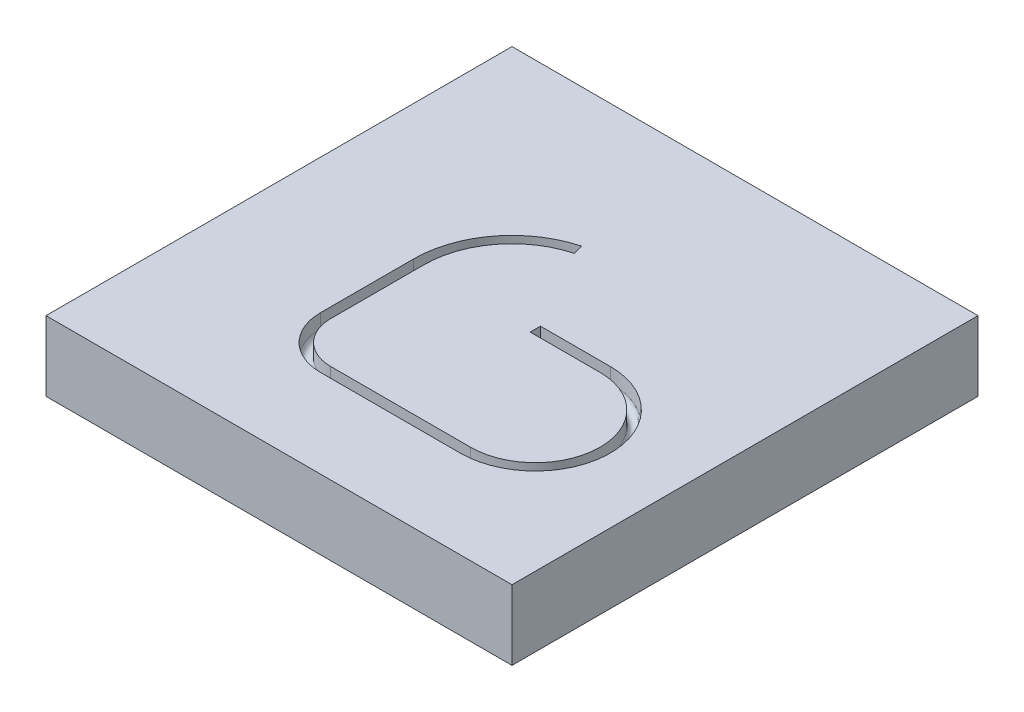
ISO-10303-21;
HEADER;
FILE_DESCRIPTION(('STEP AP214'),'2;1');
FILE_NAME('part.step','',(''),(''),'','','');
FILE_SCHEMA(('AUTOMOTIVE_DESIGN { 1 0 10303 214 1 1 1 1 }'));
ENDSEC;
DATA;
#1=APPLICATION_CONTEXT('core data for automotive mechanical design processes');
#2=APPLICATION_PROTOCOL_DEFINITION('international standard','automotive_design',2000,#1);
#3=PRODUCT_CONTEXT('',#1,'mechanical');
#4=PRODUCT('Part','Part','',(#3));
#5=PRODUCT_RELATED_PRODUCT_CATEGORY('part','',(#4));
#6=PRODUCT_DEFINITION_FORMATION('','',#4);
#7=PRODUCT_DEFINITION_CONTEXT('part definition',#1,'design');
#8=PRODUCT_DEFINITION('design','',#6,#7);
#9=PRODUCT_DEFINITION_SHAPE('','',#8);
#10=(LENGTH_UNIT() NAMED_UNIT(*) SI_UNIT(.MILLI.,.METRE.));
#11=(NAMED_UNIT(*) PLANE_ANGLE_UNIT() SI_UNIT($,.RADIAN.));
#12=(NAMED_UNIT(*) SI_UNIT($,.STERADIAN.) SOLID_ANGLE_UNIT());
#13=UNCERTAINTY_MEASURE_WITH_UNIT(LENGTH_MEASURE(1.E-05),#10,'distance_accuracy_value','');
#14=(GEOMETRIC_REPRESENTATION_CONTEXT(3) GLOBAL_UNCERTAINTY_ASSIGNED_CONTEXT((#13)) GLOBAL_UNIT_ASSIGNED_CONTEXT((#10,
#11,#12)) REPRESENTATION_CONTEXT('',''));
#15=CARTESIAN_POINT('',(0.,0.,0.));
#16=DIRECTION('',(0.,0.,1.));
#17=DIRECTION('',(1.,0.,0.));
#18=AXIS2_PLACEMENT_3D('',#15,#16,#17);
#19=CARTESIAN_POINT('',(0.,3.,0.));
#20=DIRECTION('',(0.,1.,0.));
#21=DIRECTION('',(0.,0.,1.));
#22=AXIS2_PLACEMENT_3D('',#19,#20,#21);
#23=PLANE('',#22);
#24=DIRECTION('',(0.,0.,1.));
#25=VECTOR('',#24,1.);
#26=CARTESIAN_POINT('',(-50.,3.,-50.));
#27=LINE('',#26,#25);
#28=CARTESIAN_POINT('',(-50.,3.,-50.));
#29=VERTEX_POINT('',#28);
#30=CARTESIAN_POINT('',(-50.,3.,50.));
#31=VERTEX_POINT('',#30);
#32=EDGE_CURVE('E308',#29,#31,#27,.T.);
#33=ORIENTED_EDGE('',*,*,#32,.T.);
#34=DIRECTION('',(1.,0.,0.));
#35=VECTOR('',#34,1.);
#36=CARTESIAN_POINT('',(-50.,3.,50.));
#37=LINE('',#36,#35);
#38=CARTESIAN_POINT('',(50.,3.,50.));
#39=VERTEX_POINT('',#38);
#40=EDGE_CURVE('E321',#31,#39,#37,.T.);
#41=ORIENTED_EDGE('',*,*,#40,.T.);
#42=DIRECTION('',(0.,0.,-1.));
#43=VECTOR('',#42,1.);
#44=CARTESIAN_POINT('',(50.,3.,-50.));
#45=LINE('',#44,#43);
#46=CARTESIAN_POINT('',(50.,3.,-50.));
#47=VERTEX_POINT('',#46);
#48=EDGE_CURVE('E324',#39,#47,#45,.T.);
#49=ORIENTED_EDGE('',*,*,#48,.T.);
#50=DIRECTION('',(-1.,0.,0.));
#51=VECTOR('',#50,1.);
#52=CARTESIAN_POINT('',(-50.,3.,-50.));
#53=LINE('',#52,#51);
#54=EDGE_CURVE('E312',#47,#29,#53,.T.);
#55=ORIENTED_EDGE('',*,*,#54,.T.);
#56=EDGE_LOOP('',(#33,#41,#49,#55));
#57=FACE_BOUND('',#56,.T.);
#58=DIRECTION('',(0.258819045102522,0.,0.965925826289068));
#59=VECTOR('',#58,1.);
#60=CARTESIAN_POINT('',(-5.46108185166321,3.,-20.3810349346993));
#61=LINE('',#60,#59);
#62=CARTESIAN_POINT('',(-5.46108185166321,3.,-20.3810349346993));
#63=VERTEX_POINT('',#62);
#64=CARTESIAN_POINT('',(-4.89167995243766,3.,-18.2559981168634));
#65=VERTEX_POINT('',#64);
#66=EDGE_CURVE('E168',#63,#65,#61,.T.);
#67=ORIENTED_EDGE('',*,*,#66,.T.);
#68=CARTESIAN_POINT('',(0.,3.,0.));
#69=DIRECTION('',(0.,1.,0.));
#70=DIRECTION('',(-0.258819045102522,0.,-0.965925826289068));
#71=AXIS2_PLACEMENT_3D('',#68,#69,#70);
#72=CIRCLE('',#71,18.9);
#73=CARTESIAN_POINT('',(-18.9,3.,0.));
#74=VERTEX_POINT('',#73);
#75=EDGE_CURVE('E194',#65,#74,#72,.T.);
#76=ORIENTED_EDGE('',*,*,#75,.T.);
#77=DIRECTION('',(0.,0.,1.));
#78=VECTOR('',#77,1.);
#79=CARTESIAN_POINT('',(-18.9,3.,0.));
#80=LINE('',#79,#78);
#81=CARTESIAN_POINT('',(-18.9,3.,20.));
#82=VERTEX_POINT('',#81);
#83=EDGE_CURVE('E199',#74,#82,#80,.T.);
#84=ORIENTED_EDGE('',*,*,#83,.T.);
#85=CARTESIAN_POINT('',(-10.,3.,20.));
#86=DIRECTION('',(0.,1.,0.));
#87=DIRECTION('',(-1.,0.,0.));
#88=AXIS2_PLACEMENT_3D('',#85,#86,#87);
#89=CIRCLE('',#88,8.9);
#90=CARTESIAN_POINT('',(-9.99999999999998,3.,28.9));
#91=VERTEX_POINT('',#90);
#92=EDGE_CURVE('E205',#82,#91,#89,.T.);
#93=ORIENTED_EDGE('',*,*,#92,.T.);
#94=DIRECTION('',(1.,0.,0.));
#95=VECTOR('',#94,1.);
#96=CARTESIAN_POINT('',(-9.99999999999998,3.,28.9));
#97=LINE('',#96,#95);
#98=CARTESIAN_POINT('',(20.,3.,28.9));
#99=VERTEX_POINT('',#98);
#100=EDGE_CURVE('E213',#91,#99,#97,.T.);
#101=ORIENTED_EDGE('',*,*,#100,.T.);
#102=CARTESIAN_POINT('',(20.,3.,15.));
#103=DIRECTION('',(0.,1.,0.));
#104=DIRECTION('',(0.,0.,1.));
#105=AXIS2_PLACEMENT_3D('',#102,#103,#104);
#106=CIRCLE('',#105,13.9);
#107=CARTESIAN_POINT('',(20.,3.,1.1));
#108=VERTEX_POINT('',#107);
#109=EDGE_CURVE('E221',#99,#108,#106,.T.);
#110=ORIENTED_EDGE('',*,*,#109,.T.);
#111=DIRECTION('',(-1.,0.,0.));
#112=VECTOR('',#111,1.);
#113=CARTESIAN_POINT('',(20.,3.,1.1));
#114=LINE('',#113,#112);
#115=CARTESIAN_POINT('',(4.99999999999999,3.,1.1));
#116=VERTEX_POINT('',#115);
#117=EDGE_CURVE('E229',#108,#116,#114,.T.);
#118=ORIENTED_EDGE('',*,*,#117,.T.);
#119=DIRECTION('',(0.,0.,1.));
#120=VECTOR('',#119,1.);
#121=CARTESIAN_POINT('',(4.99999999999998,3.,-1.1));
#122=LINE('',#121,#120);
#123=CARTESIAN_POINT('',(4.99999999999998,3.,-1.1));
#124=VERTEX_POINT('',#123);
#125=EDGE_CURVE('E227',#124,#116,#122,.T.);
#126=ORIENTED_EDGE('',*,*,#125,.F.);
#127=DIRECTION('',(-1.,0.,0.));
#128=VECTOR('',#127,1.);
#129=CARTESIAN_POINT('',(20.,3.,-1.1));
#130=LINE('',#129,#128);
#131=CARTESIAN_POINT('',(20.,3.,-1.1));
#132=VERTEX_POINT('',#131);
#133=EDGE_CURVE('E230',#132,#124,#130,.T.);
#134=ORIENTED_EDGE('',*,*,#133,.F.);
#135=CARTESIAN_POINT('',(20.,3.,15.));
#136=DIRECTION('',(0.,1.,0.));
#137=DIRECTION('',(0.,0.,1.));
#138=AXIS2_PLACEMENT_3D('',#135,#136,#137);
#139=CIRCLE('',#138,16.1);
#140=CARTESIAN_POINT('',(20.,3.,31.1));
#141=VERTEX_POINT('',#140);
#142=EDGE_CURVE('E52',#141,#132,#139,.T.);
#143=ORIENTED_EDGE('',*,*,#142,.F.);
#144=DIRECTION('',(1.,0.,0.));
#145=VECTOR('',#144,1.);
#146=CARTESIAN_POINT('',(-9.99999999999998,3.,31.1));
#147=LINE('',#146,#145);
#148=CARTESIAN_POINT('',(-9.99999999999998,3.,31.1));
#149=VERTEX_POINT('',#148);
#150=EDGE_CURVE('E217',#149,#141,#147,.T.);
#151=ORIENTED_EDGE('',*,*,#150,.F.);
#152=CARTESIAN_POINT('',(-10.,3.,20.));
#153=DIRECTION('',(0.,1.,0.));
#154=DIRECTION('',(-1.,0.,0.));
#155=AXIS2_PLACEMENT_3D('',#152,#153,#154);
#156=CIRCLE('',#155,11.1);
#157=CARTESIAN_POINT('',(-21.1,3.,20.));
#158=VERTEX_POINT('',#157);
#159=EDGE_CURVE('E209',#158,#149,#156,.T.);
#160=ORIENTED_EDGE('',*,*,#159,.F.);
#161=DIRECTION('',(0.,0.,1.));
#162=VECTOR('',#161,1.);
#163=CARTESIAN_POINT('',(-21.1,3.,0.));
#164=LINE('',#163,#162);
#165=CARTESIAN_POINT('',(-21.1,3.,0.));
#166=VERTEX_POINT('',#165);
#167=EDGE_CURVE('E193',#166,#158,#164,.T.);
#168=ORIENTED_EDGE('',*,*,#167,.F.);
#169=CARTESIAN_POINT('',(0.,3.,0.));
#170=DIRECTION('',(0.,1.,0.));
#171=DIRECTION('',(-0.258819045102522,0.,-0.965925826289068));
#172=AXIS2_PLACEMENT_3D('',#169,#170,#171);
#173=CIRCLE('',#172,21.1);
#174=EDGE_CURVE('E185',#63,#166,#173,.T.);
#175=ORIENTED_EDGE('',*,*,#174,.F.);
#176=EDGE_LOOP('',(#67,#76,#84,#93,#101,#110,#118,#126,#134,#143,#151,#160,#168,#175));
#177=FACE_BOUND('',#176,.T.);
#178=ADVANCED_FACE('F35',(#57,#177),#23,.T.);
#179=CARTESIAN_POINT('',(-50.,-12.,-50.));
#180=DIRECTION('',(-1.,0.,0.));
#181=DIRECTION('',(0.,0.,1.));
#182=AXIS2_PLACEMENT_3D('',#179,#180,#181);
#183=PLANE('',#182);
#184=ORIENTED_EDGE('',*,*,#32,.F.);
#185=DIRECTION('',(0.,1.,0.));
#186=VECTOR('',#185,1.);
#187=CARTESIAN_POINT('',(-50.,-12.,-50.));
#188=LINE('',#187,#186);
#189=CARTESIAN_POINT('',(-50.,-12.,-50.));
#190=VERTEX_POINT('',#189);
#191=EDGE_CURVE('E11',#190,#29,#188,.T.);
#192=ORIENTED_EDGE('',*,*,#191,.F.);
#193=DIRECTION('',(0.,0.,1.));
#194=VECTOR('',#193,1.);
#195=CARTESIAN_POINT('',(-50.,-12.,-50.));
#196=LINE('',#195,#194);
#197=CARTESIAN_POINT('',(-50.,-12.,50.));
#198=VERTEX_POINT('',#197);
#199=EDGE_CURVE('E309',#190,#198,#196,.T.);
#200=ORIENTED_EDGE('',*,*,#199,.T.);
#201=DIRECTION('',(0.,1.,0.));
#202=VECTOR('',#201,1.);
#203=CARTESIAN_POINT('',(-50.,-12.,50.));
#204=LINE('',#203,#202);
#205=EDGE_CURVE('E39',#198,#31,#204,.T.);
#206=ORIENTED_EDGE('',*,*,#205,.T.);
#207=EDGE_LOOP('',(#184,#192,#200,#206));
#208=FACE_BOUND('',#207,.T.);
#209=ADVANCED_FACE('F37',(#208),#183,.T.);
#210=CARTESIAN_POINT('',(-50.,-12.,-50.));
#211=DIRECTION('',(0.,0.,-1.));
#212=DIRECTION('',(-1.,0.,0.));
#213=AXIS2_PLACEMENT_3D('',#210,#211,#212);
#214=PLANE('',#213);
#215=ORIENTED_EDGE('',*,*,#54,.F.);
#216=DIRECTION('',(0.,1.,0.));
#217=VECTOR('',#216,1.);
#218=CARTESIAN_POINT('',(50.,-12.,-50.));
#219=LINE('',#218,#217);
#220=CARTESIAN_POINT('',(50.,-12.,-50.));
#221=VERTEX_POINT('',#220);
#222=EDGE_CURVE('E44',#221,#47,#219,.T.);
#223=ORIENTED_EDGE('',*,*,#222,.F.);
#224=DIRECTION('',(-1.,0.,0.));
#225=VECTOR('',#224,1.);
#226=CARTESIAN_POINT('',(-50.,-12.,-50.));
#227=LINE('',#226,#225);
#228=EDGE_CURVE('E317',#221,#190,#227,.T.);
#229=ORIENTED_EDGE('',*,*,#228,.T.);
#230=ORIENTED_EDGE('',*,*,#191,.T.);
#231=EDGE_LOOP('',(#215,#223,#229,#230));
#232=FACE_BOUND('',#231,.T.);
#233=ADVANCED_FACE('F333',(#232),#214,.T.);
#234=CARTESIAN_POINT('',(50.,-12.,-50.));
#235=DIRECTION('',(1.,0.,0.));
#236=DIRECTION('',(0.,0.,-1.));
#237=AXIS2_PLACEMENT_3D('',#234,#235,#236);
#238=PLANE('',#237);
#239=ORIENTED_EDGE('',*,*,#48,.F.);
#240=DIRECTION('',(0.,1.,0.));
#241=VECTOR('',#240,1.);
#242=CARTESIAN_POINT('',(50.,-12.,50.));
#243=LINE('',#242,#241);
#244=CARTESIAN_POINT('',(50.,-12.,50.));
#245=VERTEX_POINT('',#244);
#246=EDGE_CURVE('E329',#245,#39,#243,.T.);
#247=ORIENTED_EDGE('',*,*,#246,.F.);
#248=DIRECTION('',(0.,0.,-1.));
#249=VECTOR('',#248,1.);
#250=CARTESIAN_POINT('',(50.,-12.,-50.));
#251=LINE('',#250,#249);
#252=EDGE_CURVE('E314',#245,#221,#251,.T.);
#253=ORIENTED_EDGE('',*,*,#252,.T.);
#254=ORIENTED_EDGE('',*,*,#222,.T.);
#255=EDGE_LOOP('',(#239,#247,#253,#254));
#256=FACE_BOUND('',#255,.T.);
#257=ADVANCED_FACE('F337',(#256),#238,.T.);
#258=CARTESIAN_POINT('',(-50.,-12.,50.));
#259=DIRECTION('',(0.,0.,1.));
#260=DIRECTION('',(1.,0.,0.));
#261=AXIS2_PLACEMENT_3D('',#258,#259,#260);
#262=PLANE('',#261);
#263=ORIENTED_EDGE('',*,*,#40,.F.);
#264=ORIENTED_EDGE('',*,*,#205,.F.);
#265=DIRECTION('',(1.,0.,0.));
#266=VECTOR('',#265,1.);
#267=CARTESIAN_POINT('',(-50.,-12.,50.));
#268=LINE('',#267,#266);
#269=EDGE_CURVE('E311',#198,#245,#268,.T.);
#270=ORIENTED_EDGE('',*,*,#269,.T.);
#271=ORIENTED_EDGE('',*,*,#246,.T.);
#272=EDGE_LOOP('',(#263,#264,#270,#271));
#273=FACE_BOUND('',#272,.T.);
#274=ADVANCED_FACE('F331',(#273),#262,.T.);
#275=CARTESIAN_POINT('',(0.,-12.,0.));
#276=DIRECTION('',(0.,1.,0.));
#277=DIRECTION('',(0.,0.,1.));
#278=AXIS2_PLACEMENT_3D('',#275,#276,#277);
#279=PLANE('',#278);
#280=ORIENTED_EDGE('',*,*,#199,.F.);
#281=ORIENTED_EDGE('',*,*,#228,.F.);
#282=ORIENTED_EDGE('',*,*,#252,.F.);
#283=ORIENTED_EDGE('',*,*,#269,.F.);
#284=EDGE_LOOP('',(#280,#281,#282,#283));
#285=FACE_BOUND('',#284,.T.);
#286=ADVANCED_FACE('F339',(#285),#279,.F.);
#287=CARTESIAN_POINT('',(-5.17638090205043,0.,-19.3185165257814));
#288=DIRECTION('',(0.965925826289068,0.,-0.258819045102522));
#289=DIRECTION('',(-0.258819045102522,0.,-0.965925826289068));
#290=AXIS2_PLACEMENT_3D('',#287,#288,#289);
#291=PLANE('',#290);
#292=CARTESIAN_POINT('',(-5.17638090205043,0.,-19.3185165257814));
#293=DIRECTION('',(0.965925826289068,0.,-0.258819045102522));
#294=DIRECTION('',(-0.258819045102522,0.,-0.965925826289068));
#295=AXIS2_PLACEMENT_3D('',#292,#293,#294);
#296=CIRCLE('',#295,1.1);
#297=CARTESIAN_POINT('',(-4.89167995243766,0.,-18.2559981168634));
#298=VERTEX_POINT('',#297);
#299=CARTESIAN_POINT('',(-5.46108185166321,0.,-20.3810349346993));
#300=VERTEX_POINT('',#299);
#301=EDGE_CURVE('E189',#298,#300,#296,.T.);
#302=ORIENTED_EDGE('',*,*,#301,.F.);
#303=DIRECTION('',(0.,-1.,0.));
#304=VECTOR('',#303,1.);
#305=CARTESIAN_POINT('',(-4.89167995243766,0.,-18.2559981168634));
#306=LINE('',#305,#304);
#307=EDGE_CURVE('E174',#65,#298,#306,.T.);
#308=ORIENTED_EDGE('',*,*,#307,.F.);
#309=ORIENTED_EDGE('',*,*,#66,.F.);
#310=DIRECTION('',(0.,1.,0.));
#311=VECTOR('',#310,1.);
#312=CARTESIAN_POINT('',(-5.46108185166321,0.,-20.3810349346993));
#313=LINE('',#312,#311);
#314=EDGE_CURVE('E171',#300,#63,#313,.T.);
#315=ORIENTED_EDGE('',*,*,#314,.F.);
#316=EDGE_LOOP('',(#302,#308,#309,#315));
#317=FACE_BOUND('',#316,.T.);
#318=ADVANCED_FACE('F170',(#317),#291,.F.);
#319=CARTESIAN_POINT('',(4.99999999999999,0.,0.));
#320=DIRECTION('',(1.,0.,0.));
#321=DIRECTION('',(0.,0.,-1.));
#322=AXIS2_PLACEMENT_3D('',#319,#320,#321);
#323=PLANE('',#322);
#324=CARTESIAN_POINT('',(4.99999999999999,0.,0.));
#325=DIRECTION('',(1.,0.,0.));
#326=DIRECTION('',(0.,0.,-1.));
#327=AXIS2_PLACEMENT_3D('',#324,#325,#326);
#328=CIRCLE('',#327,1.1);
#329=CARTESIAN_POINT('',(4.99999999999999,0.,1.1));
#330=VERTEX_POINT('',#329);
#331=CARTESIAN_POINT('',(4.99999999999998,0.,-1.1));
#332=VERTEX_POINT('',#331);
#333=EDGE_CURVE('E272',#330,#332,#328,.T.);
#334=ORIENTED_EDGE('',*,*,#333,.T.);
#335=DIRECTION('',(0.,1.,0.));
#336=VECTOR('',#335,1.);
#337=CARTESIAN_POINT('',(4.99999999999998,0.,-1.1));
#338=LINE('',#337,#336);
#339=EDGE_CURVE('E300',#332,#124,#338,.T.);
#340=ORIENTED_EDGE('',*,*,#339,.T.);
#341=ORIENTED_EDGE('',*,*,#125,.T.);
#342=DIRECTION('',(0.,-1.,0.));
#343=VECTOR('',#342,1.);
#344=CARTESIAN_POINT('',(4.99999999999999,0.,1.1));
#345=LINE('',#344,#343);
#346=EDGE_CURVE('E233',#116,#330,#345,.T.);
#347=ORIENTED_EDGE('',*,*,#346,.T.);
#348=EDGE_LOOP('',(#334,#340,#341,#347));
#349=FACE_BOUND('',#348,.T.);
#350=ADVANCED_FACE('F347',(#349),#323,.T.);
#351=CARTESIAN_POINT('',(0.,0.,0.));
#352=DIRECTION('',(0.,1.,0.));
#353=DIRECTION('',(0.,0.,1.));
#354=AXIS2_PLACEMENT_3D('',#351,#352,#353);
#355=CYLINDRICAL_SURFACE('',#354,18.9);
#356=CARTESIAN_POINT('',(0.,0.,0.));
#357=DIRECTION('',(0.,1.,0.));
#358=DIRECTION('',(-0.258819045102522,0.,-0.965925826289068));
#359=AXIS2_PLACEMENT_3D('',#356,#357,#358);
#360=CIRCLE('',#359,18.9);
#361=CARTESIAN_POINT('',(-18.9,0.,0.));
#362=VERTEX_POINT('',#361);
#363=EDGE_CURVE('E240',#298,#362,#360,.T.);
#364=ORIENTED_EDGE('',*,*,#363,.T.);
#365=DIRECTION('',(0.,-1.,0.));
#366=VECTOR('',#365,1.);
#367=CARTESIAN_POINT('',(-18.9,0.,0.));
#368=LINE('',#367,#366);
#369=EDGE_CURVE('E196',#74,#362,#368,.T.);
#370=ORIENTED_EDGE('',*,*,#369,.F.);
#371=ORIENTED_EDGE('',*,*,#75,.F.);
#372=ORIENTED_EDGE('',*,*,#307,.T.);
#373=EDGE_LOOP('',(#364,#370,#371,#372));
#374=FACE_BOUND('',#373,.T.);
#375=ADVANCED_FACE('F393',(#374),#355,.T.);
#376=CARTESIAN_POINT('',(0.,0.,0.));
#377=DIRECTION('',(0.,1.,0.));
#378=DIRECTION('',(0.,0.,1.));
#379=AXIS2_PLACEMENT_3D('',#376,#377,#378);
#380=TOROIDAL_SURFACE('',#379,20.,1.1);
#381=CARTESIAN_POINT('',(0.,0.,0.));
#382=DIRECTION('',(0.,1.,0.));
#383=DIRECTION('',(-0.258819045102522,0.,-0.965925826289068));
#384=AXIS2_PLACEMENT_3D('',#381,#382,#383);
#385=CIRCLE('',#384,21.1);
#386=CARTESIAN_POINT('',(-21.1,0.,0.));
#387=VERTEX_POINT('',#386);
#388=EDGE_CURVE('E188',#300,#387,#385,.T.);
#389=ORIENTED_EDGE('',*,*,#388,.T.);
#390=CARTESIAN_POINT('',(-20.,0.,0.));
#391=DIRECTION('',(0.,0.,-1.));
#392=DIRECTION('',(-1.,0.,0.));
#393=AXIS2_PLACEMENT_3D('',#390,#391,#392);
#394=CIRCLE('',#393,1.1);
#395=EDGE_CURVE('E243',#362,#387,#394,.T.);
#396=ORIENTED_EDGE('',*,*,#395,.F.);
#397=ORIENTED_EDGE('',*,*,#363,.F.);
#398=ORIENTED_EDGE('',*,*,#301,.T.);
#399=EDGE_LOOP('',(#389,#396,#397,#398));
#400=FACE_BOUND('',#399,.T.);
#401=ADVANCED_FACE('F403',(#400),#380,.F.);
#402=CARTESIAN_POINT('',(0.,0.,0.));
#403=DIRECTION('',(0.,1.,0.));
#404=DIRECTION('',(0.,0.,1.));
#405=AXIS2_PLACEMENT_3D('',#402,#403,#404);
#406=CYLINDRICAL_SURFACE('',#405,21.1);
#407=DIRECTION('',(0.,1.,0.));
#408=VECTOR('',#407,1.);
#409=CARTESIAN_POINT('',(-21.1,0.,0.));
#410=LINE('',#409,#408);
#411=EDGE_CURVE('E204',#387,#166,#410,.T.);
#412=ORIENTED_EDGE('',*,*,#411,.F.);
#413=ORIENTED_EDGE('',*,*,#388,.F.);
#414=ORIENTED_EDGE('',*,*,#314,.T.);
#415=ORIENTED_EDGE('',*,*,#174,.T.);
#416=EDGE_LOOP('',(#412,#413,#414,#415));
#417=FACE_BOUND('',#416,.T.);
#418=ADVANCED_FACE('F184',(#417),#406,.F.);
#419=CARTESIAN_POINT('',(-18.9,0.,0.));
#420=DIRECTION('',(-1.,0.,0.));
#421=DIRECTION('',(0.,-1.,0.));
#422=AXIS2_PLACEMENT_3D('',#419,#420,#421);
#423=PLANE('',#422);
#424=DIRECTION('',(0.,0.,1.));
#425=VECTOR('',#424,1.);
#426=CARTESIAN_POINT('',(-18.9,0.,0.));
#427=LINE('',#426,#425);
#428=CARTESIAN_POINT('',(-18.9,0.,20.));
#429=VERTEX_POINT('',#428);
#430=EDGE_CURVE('E246',#362,#429,#427,.T.);
#431=ORIENTED_EDGE('',*,*,#430,.T.);
#432=DIRECTION('',(0.,-1.,0.));
#433=VECTOR('',#432,1.);
#434=CARTESIAN_POINT('',(-18.9,0.,20.));
#435=LINE('',#434,#433);
#436=EDGE_CURVE('E202',#82,#429,#435,.T.);
#437=ORIENTED_EDGE('',*,*,#436,.F.);
#438=ORIENTED_EDGE('',*,*,#83,.F.);
#439=ORIENTED_EDGE('',*,*,#369,.T.);
#440=EDGE_LOOP('',(#431,#437,#438,#439));
#441=FACE_BOUND('',#440,.T.);
#442=ADVANCED_FACE('F422',(#441),#423,.T.);
#443=CARTESIAN_POINT('',(-20.,0.,0.));
#444=DIRECTION('',(0.,0.,1.));
#445=DIRECTION('',(1.,0.,0.));
#446=AXIS2_PLACEMENT_3D('',#443,#444,#445);
#447=CYLINDRICAL_SURFACE('',#446,1.1);
#448=DIRECTION('',(0.,0.,1.));
#449=VECTOR('',#448,1.);
#450=CARTESIAN_POINT('',(-21.1,0.,0.));
#451=LINE('',#450,#449);
#452=CARTESIAN_POINT('',(-21.1,0.,20.));
#453=VERTEX_POINT('',#452);
#454=EDGE_CURVE('E279',#387,#453,#451,.T.);
#455=ORIENTED_EDGE('',*,*,#454,.T.);
#456=CARTESIAN_POINT('',(-20.,0.,20.));
#457=DIRECTION('',(0.,0.,-1.));
#458=DIRECTION('',(-1.,0.,0.));
#459=AXIS2_PLACEMENT_3D('',#456,#457,#458);
#460=CIRCLE('',#459,1.1);
#461=EDGE_CURVE('E249',#429,#453,#460,.T.);
#462=ORIENTED_EDGE('',*,*,#461,.F.);
#463=ORIENTED_EDGE('',*,*,#430,.F.);
#464=ORIENTED_EDGE('',*,*,#395,.T.);
#465=EDGE_LOOP('',(#455,#462,#463,#464));
#466=FACE_BOUND('',#465,.T.);
#467=ADVANCED_FACE('F431',(#466),#447,.F.);
#468=CARTESIAN_POINT('',(-21.1,0.,0.));
#469=DIRECTION('',(1.,0.,0.));
#470=DIRECTION('',(0.,0.,-1.));
#471=AXIS2_PLACEMENT_3D('',#468,#469,#470);
#472=PLANE('',#471);
#473=DIRECTION('',(0.,1.,0.));
#474=VECTOR('',#473,1.);
#475=CARTESIAN_POINT('',(-21.1,0.,20.));
#476=LINE('',#475,#474);
#477=EDGE_CURVE('E212',#453,#158,#476,.T.);
#478=ORIENTED_EDGE('',*,*,#477,.F.);
#479=ORIENTED_EDGE('',*,*,#454,.F.);
#480=ORIENTED_EDGE('',*,*,#411,.T.);
#481=ORIENTED_EDGE('',*,*,#167,.T.);
#482=EDGE_LOOP('',(#478,#479,#480,#481));
#483=FACE_BOUND('',#482,.T.);
#484=ADVANCED_FACE('F441',(#483),#472,.T.);
#485=CARTESIAN_POINT('',(-10.,0.,20.));
#486=DIRECTION('',(0.,1.,0.));
#487=DIRECTION('',(0.,0.,1.));
#488=AXIS2_PLACEMENT_3D('',#485,#486,#487);
#489=CYLINDRICAL_SURFACE('',#488,8.9);
#490=CARTESIAN_POINT('',(-10.,0.,20.));
#491=DIRECTION('',(0.,1.,0.));
#492=DIRECTION('',(-1.,0.,0.));
#493=AXIS2_PLACEMENT_3D('',#490,#491,#492);
#494=CIRCLE('',#493,8.9);
#495=CARTESIAN_POINT('',(-9.99999999999998,0.,28.9));
#496=VERTEX_POINT('',#495);
#497=EDGE_CURVE('E252',#429,#496,#494,.T.);
#498=ORIENTED_EDGE('',*,*,#497,.T.);
#499=DIRECTION('',(0.,-1.,0.));
#500=VECTOR('',#499,1.);
#501=CARTESIAN_POINT('',(-9.99999999999998,0.,28.9));
#502=LINE('',#501,#500);
#503=EDGE_CURVE('E208',#91,#496,#502,.T.);
#504=ORIENTED_EDGE('',*,*,#503,.F.);
#505=ORIENTED_EDGE('',*,*,#92,.F.);
#506=ORIENTED_EDGE('',*,*,#436,.T.);
#507=EDGE_LOOP('',(#498,#504,#505,#506));
#508=FACE_BOUND('',#507,.T.);
#509=ADVANCED_FACE('F451',(#508),#489,.T.);
#510=CARTESIAN_POINT('',(-10.,0.,20.));
#511=DIRECTION('',(0.,1.,0.));
#512=DIRECTION('',(0.,0.,1.));
#513=AXIS2_PLACEMENT_3D('',#510,#511,#512);
#514=TOROIDAL_SURFACE('',#513,10.,1.1);
#515=CARTESIAN_POINT('',(-10.,0.,20.));
#516=DIRECTION('',(0.,1.,0.));
#517=DIRECTION('',(-1.,0.,0.));
#518=AXIS2_PLACEMENT_3D('',#515,#516,#517);
#519=CIRCLE('',#518,11.1);
#520=CARTESIAN_POINT('',(-9.99999999999998,0.,31.1));
#521=VERTEX_POINT('',#520);
#522=EDGE_CURVE('E284',#453,#521,#519,.T.);
#523=ORIENTED_EDGE('',*,*,#522,.T.);
#524=CARTESIAN_POINT('',(-9.99999999999998,0.,30.));
#525=DIRECTION('',(-1.,0.,0.));
#526=DIRECTION('',(0.,0.,1.));
#527=AXIS2_PLACEMENT_3D('',#524,#525,#526);
#528=CIRCLE('',#527,1.1);
#529=EDGE_CURVE('E255',#496,#521,#528,.T.);
#530=ORIENTED_EDGE('',*,*,#529,.F.);
#531=ORIENTED_EDGE('',*,*,#497,.F.);
#532=ORIENTED_EDGE('',*,*,#461,.T.);
#533=EDGE_LOOP('',(#523,#530,#531,#532));
#534=FACE_BOUND('',#533,.T.);
#535=ADVANCED_FACE('F461',(#534),#514,.F.);
#536=CARTESIAN_POINT('',(-10.,0.,20.));
#537=DIRECTION('',(0.,1.,0.));
#538=DIRECTION('',(0.,0.,1.));
#539=AXIS2_PLACEMENT_3D('',#536,#537,#538);
#540=CYLINDRICAL_SURFACE('',#539,11.1);
#541=DIRECTION('',(0.,1.,0.));
#542=VECTOR('',#541,1.);
#543=CARTESIAN_POINT('',(-9.99999999999998,0.,31.1));
#544=LINE('',#543,#542);
#545=EDGE_CURVE('E220',#521,#149,#544,.T.);
#546=ORIENTED_EDGE('',*,*,#545,.F.);
#547=ORIENTED_EDGE('',*,*,#522,.F.);
#548=ORIENTED_EDGE('',*,*,#477,.T.);
#549=ORIENTED_EDGE('',*,*,#159,.T.);
#550=EDGE_LOOP('',(#546,#547,#548,#549));
#551=FACE_BOUND('',#550,.T.);
#552=ADVANCED_FACE('F471',(#551),#540,.F.);
#553=CARTESIAN_POINT('',(-9.99999999999998,0.,28.9));
#554=DIRECTION('',(0.,0.,1.));
#555=DIRECTION('',(0.,-1.,0.));
#556=AXIS2_PLACEMENT_3D('',#553,#554,#555);
#557=PLANE('',#556);
#558=DIRECTION('',(1.,0.,0.));
#559=VECTOR('',#558,1.);
#560=CARTESIAN_POINT('',(-9.99999999999998,0.,28.9));
#561=LINE('',#560,#559);
#562=CARTESIAN_POINT('',(20.,0.,28.9));
#563=VERTEX_POINT('',#562);
#564=EDGE_CURVE('E258',#496,#563,#561,.T.);
#565=ORIENTED_EDGE('',*,*,#564,.T.);
#566=DIRECTION('',(0.,-1.,0.));
#567=VECTOR('',#566,1.);
#568=CARTESIAN_POINT('',(20.,0.,28.9));
#569=LINE('',#568,#567);
#570=EDGE_CURVE('E216',#99,#563,#569,.T.);
#571=ORIENTED_EDGE('',*,*,#570,.F.);
#572=ORIENTED_EDGE('',*,*,#100,.F.);
#573=ORIENTED_EDGE('',*,*,#503,.T.);
#574=EDGE_LOOP('',(#565,#571,#572,#573));
#575=FACE_BOUND('',#574,.T.);
#576=ADVANCED_FACE('F481',(#575),#557,.T.);
#577=CARTESIAN_POINT('',(-9.99999999999998,0.,30.));
#578=DIRECTION('',(1.,0.,0.));
#579=DIRECTION('',(0.,0.,-1.));
#580=AXIS2_PLACEMENT_3D('',#577,#578,#579);
#581=CYLINDRICAL_SURFACE('',#580,1.1);
#582=DIRECTION('',(1.,0.,0.));
#583=VECTOR('',#582,1.);
#584=CARTESIAN_POINT('',(-9.99999999999998,0.,31.1));
#585=LINE('',#584,#583);
#586=CARTESIAN_POINT('',(20.,0.,31.1));
#587=VERTEX_POINT('',#586);
#588=EDGE_CURVE('E289',#521,#587,#585,.T.);
#589=ORIENTED_EDGE('',*,*,#588,.T.);
#590=CARTESIAN_POINT('',(20.,0.,30.));
#591=DIRECTION('',(-1.,0.,0.));
#592=DIRECTION('',(0.,0.,1.));
#593=AXIS2_PLACEMENT_3D('',#590,#591,#592);
#594=CIRCLE('',#593,1.1);
#595=EDGE_CURVE('E261',#563,#587,#594,.T.);
#596=ORIENTED_EDGE('',*,*,#595,.F.);
#597=ORIENTED_EDGE('',*,*,#564,.F.);
#598=ORIENTED_EDGE('',*,*,#529,.T.);
#599=EDGE_LOOP('',(#589,#596,#597,#598));
#600=FACE_BOUND('',#599,.T.);
#601=ADVANCED_FACE('F491',(#600),#581,.F.);
#602=CARTESIAN_POINT('',(-9.99999999999998,0.,31.1));
#603=DIRECTION('',(0.,0.,-1.));
#604=DIRECTION('',(-1.,0.,0.));
#605=AXIS2_PLACEMENT_3D('',#602,#603,#604);
#606=PLANE('',#605);
#607=DIRECTION('',(0.,1.,0.));
#608=VECTOR('',#607,1.);
#609=CARTESIAN_POINT('',(20.,0.,31.1));
#610=LINE('',#609,#608);
#611=EDGE_CURVE('E226',#587,#141,#610,.T.);
#612=ORIENTED_EDGE('',*,*,#611,.F.);
#613=ORIENTED_EDGE('',*,*,#588,.F.);
#614=ORIENTED_EDGE('',*,*,#545,.T.);
#615=ORIENTED_EDGE('',*,*,#150,.T.);
#616=EDGE_LOOP('',(#612,#613,#614,#615));
#617=FACE_BOUND('',#616,.T.);
#618=ADVANCED_FACE('F501',(#617),#606,.T.);
#619=CARTESIAN_POINT('',(20.,0.,15.));
#620=DIRECTION('',(0.,1.,0.));
#621=DIRECTION('',(0.,0.,1.));
#622=AXIS2_PLACEMENT_3D('',#619,#620,#621);
#623=CYLINDRICAL_SURFACE('',#622,13.9);
#624=CARTESIAN_POINT('',(20.,0.,15.));
#625=DIRECTION('',(0.,1.,0.));
#626=DIRECTION('',(0.,0.,1.));
#627=AXIS2_PLACEMENT_3D('',#624,#625,#626);
#628=CIRCLE('',#627,13.9);
#629=CARTESIAN_POINT('',(20.,0.,1.1));
#630=VERTEX_POINT('',#629);
#631=EDGE_CURVE('E264',#563,#630,#628,.T.);
#632=ORIENTED_EDGE('',*,*,#631,.T.);
#633=DIRECTION('',(0.,-1.,0.));
#634=VECTOR('',#633,1.);
#635=CARTESIAN_POINT('',(20.,0.,1.1));
#636=LINE('',#635,#634);
#637=EDGE_CURVE('E224',#108,#630,#636,.T.);
#638=ORIENTED_EDGE('',*,*,#637,.F.);
#639=ORIENTED_EDGE('',*,*,#109,.F.);
#640=ORIENTED_EDGE('',*,*,#570,.T.);
#641=EDGE_LOOP('',(#632,#638,#639,#640));
#642=FACE_BOUND('',#641,.T.);
#643=ADVANCED_FACE('F511',(#642),#623,.T.);
#644=CARTESIAN_POINT('',(20.,0.,15.));
#645=DIRECTION('',(0.,1.,0.));
#646=DIRECTION('',(0.,0.,1.));
#647=AXIS2_PLACEMENT_3D('',#644,#645,#646);
#648=TOROIDAL_SURFACE('',#647,15.,1.1);
#649=CARTESIAN_POINT('',(20.,0.,15.));
#650=DIRECTION('',(0.,1.,0.));
#651=DIRECTION('',(0.,0.,1.));
#652=AXIS2_PLACEMENT_3D('',#649,#650,#651);
#653=CIRCLE('',#652,16.1);
#654=CARTESIAN_POINT('',(20.,0.,-1.1));
#655=VERTEX_POINT('',#654);
#656=EDGE_CURVE('E294',#587,#655,#653,.T.);
#657=ORIENTED_EDGE('',*,*,#656,.T.);
#658=CARTESIAN_POINT('',(20.,0.,0.));
#659=DIRECTION('',(1.,0.,0.));
#660=DIRECTION('',(0.,0.,-1.));
#661=AXIS2_PLACEMENT_3D('',#658,#659,#660);
#662=CIRCLE('',#661,1.1);
#663=EDGE_CURVE('E267',#630,#655,#662,.T.);
#664=ORIENTED_EDGE('',*,*,#663,.F.);
#665=ORIENTED_EDGE('',*,*,#631,.F.);
#666=ORIENTED_EDGE('',*,*,#595,.T.);
#667=EDGE_LOOP('',(#657,#664,#665,#666));
#668=FACE_BOUND('',#667,.T.);
#669=ADVANCED_FACE('F521',(#668),#648,.F.);
#670=CARTESIAN_POINT('',(20.,0.,15.));
#671=DIRECTION('',(0.,1.,0.));
#672=DIRECTION('',(0.,0.,1.));
#673=AXIS2_PLACEMENT_3D('',#670,#671,#672);
#674=CYLINDRICAL_SURFACE('',#673,16.1);
#675=DIRECTION('',(0.,1.,0.));
#676=VECTOR('',#675,1.);
#677=CARTESIAN_POINT('',(20.,0.,-1.1));
#678=LINE('',#677,#676);
#679=EDGE_CURVE('E236',#655,#132,#678,.T.);
#680=ORIENTED_EDGE('',*,*,#679,.F.);
#681=ORIENTED_EDGE('',*,*,#656,.F.);
#682=ORIENTED_EDGE('',*,*,#611,.T.);
#683=ORIENTED_EDGE('',*,*,#142,.T.);
#684=EDGE_LOOP('',(#680,#681,#682,#683));
#685=FACE_BOUND('',#684,.T.);
#686=ADVANCED_FACE('F531',(#685),#674,.F.);
#687=CARTESIAN_POINT('',(20.,0.,1.1));
#688=DIRECTION('',(0.,0.,-1.));
#689=DIRECTION('',(0.,1.,0.));
#690=AXIS2_PLACEMENT_3D('',#687,#688,#689);
#691=PLANE('',#690);
#692=DIRECTION('',(-1.,0.,0.));
#693=VECTOR('',#692,1.);
#694=CARTESIAN_POINT('',(20.,0.,1.1));
#695=LINE('',#694,#693);
#696=EDGE_CURVE('E269',#630,#330,#695,.T.);
#697=ORIENTED_EDGE('',*,*,#696,.T.);
#698=ORIENTED_EDGE('',*,*,#346,.F.);
#699=ORIENTED_EDGE('',*,*,#117,.F.);
#700=ORIENTED_EDGE('',*,*,#637,.T.);
#701=EDGE_LOOP('',(#697,#698,#699,#700));
#702=FACE_BOUND('',#701,.T.);
#703=ADVANCED_FACE('F541',(#702),#691,.T.);
#704=CARTESIAN_POINT('',(20.,0.,0.));
#705=DIRECTION('',(-1.,0.,0.));
#706=DIRECTION('',(0.,0.,1.));
#707=AXIS2_PLACEMENT_3D('',#704,#705,#706);
#708=CYLINDRICAL_SURFACE('',#707,1.1);
#709=DIRECTION('',(-1.,0.,0.));
#710=VECTOR('',#709,1.);
#711=CARTESIAN_POINT('',(20.,0.,-1.1));
#712=LINE('',#711,#710);
#713=EDGE_CURVE('E298',#655,#332,#712,.T.);
#714=ORIENTED_EDGE('',*,*,#713,.T.);
#715=ORIENTED_EDGE('',*,*,#333,.F.);
#716=ORIENTED_EDGE('',*,*,#696,.F.);
#717=ORIENTED_EDGE('',*,*,#663,.T.);
#718=EDGE_LOOP('',(#714,#715,#716,#717));
#719=FACE_BOUND('',#718,.T.);
#720=ADVANCED_FACE('F351',(#719),#708,.F.);
#721=CARTESIAN_POINT('',(20.,0.,-1.1));
#722=DIRECTION('',(0.,0.,1.));
#723=DIRECTION('',(1.,0.,0.));
#724=AXIS2_PLACEMENT_3D('',#721,#722,#723);
#725=PLANE('',#724);
#726=ORIENTED_EDGE('',*,*,#339,.F.);
#727=ORIENTED_EDGE('',*,*,#713,.F.);
#728=ORIENTED_EDGE('',*,*,#679,.T.);
#729=ORIENTED_EDGE('',*,*,#133,.T.);
#730=EDGE_LOOP('',(#726,#727,#728,#729));
#731=FACE_BOUND('',#730,.T.);
#732=ADVANCED_FACE('F342',(#731),#725,.T.);
#733=CLOSED_SHELL('',(#178,#209,#233,#257,#274,#286,#318,#350,#375,#401,#418,#442,#467,#484,
#509,#535,#552,#576,#601,#618,#643,#669,#686,#703,#720,#732));
#734=MANIFOLD_SOLID_BREP('B2',#733);
#735=ADVANCED_BREP_SHAPE_REPRESENTATION('',(#18,#734),#14);
#736=SHAPE_DEFINITION_REPRESENTATION(#9,#735);
ENDSEC;
END-ISO-10303-21;
